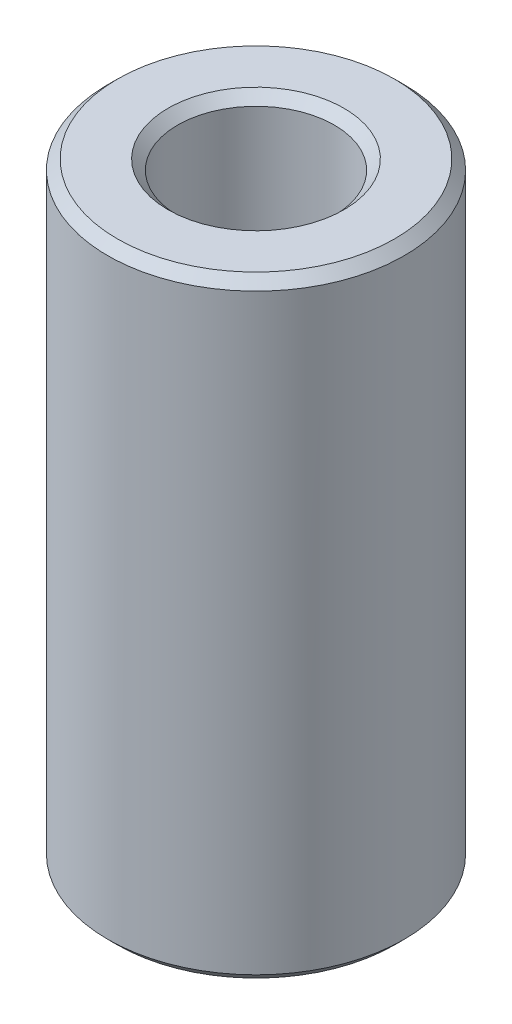
ISO-10303-21;
HEADER;
FILE_DESCRIPTION(('STEP AP214'),'2;1');
FILE_NAME('part.step','',(''),(''),'','','');
FILE_SCHEMA(('AUTOMOTIVE_DESIGN { 1 0 10303 214 1 1 1 1 }'));
ENDSEC;
DATA;
#1=APPLICATION_CONTEXT('core data for automotive mechanical design processes');
#2=APPLICATION_PROTOCOL_DEFINITION('international standard','automotive_design',2000,#1);
#3=PRODUCT_CONTEXT('',#1,'mechanical');
#4=PRODUCT('Part','Part','',(#3));
#5=PRODUCT_RELATED_PRODUCT_CATEGORY('part','',(#4));
#6=PRODUCT_DEFINITION_FORMATION('','',#4);
#7=PRODUCT_DEFINITION_CONTEXT('part definition',#1,'design');
#8=PRODUCT_DEFINITION('design','',#6,#7);
#9=PRODUCT_DEFINITION_SHAPE('','',#8);
#10=(LENGTH_UNIT() NAMED_UNIT(*) SI_UNIT(.MILLI.,.METRE.));
#11=(NAMED_UNIT(*) PLANE_ANGLE_UNIT() SI_UNIT($,.RADIAN.));
#12=(NAMED_UNIT(*) SI_UNIT($,.STERADIAN.) SOLID_ANGLE_UNIT());
#13=UNCERTAINTY_MEASURE_WITH_UNIT(LENGTH_MEASURE(1.E-05),#10,'distance_accuracy_value','');
#14=(GEOMETRIC_REPRESENTATION_CONTEXT(3) GLOBAL_UNCERTAINTY_ASSIGNED_CONTEXT((#13)) GLOBAL_UNIT_ASSIGNED_CONTEXT((#10,
#11,#12)) REPRESENTATION_CONTEXT('',''));
#15=CARTESIAN_POINT('',(0.,0.,0.));
#16=DIRECTION('',(0.,0.,1.));
#17=DIRECTION('',(1.,0.,0.));
#18=AXIS2_PLACEMENT_3D('',#15,#16,#17);
#19=CARTESIAN_POINT('',(0.,247.519173800323,0.));
#20=DIRECTION('',(0.,-1.,0.));
#21=DIRECTION('',(0.,0.,-1.));
#22=AXIS2_PLACEMENT_3D('',#19,#20,#21);
#23=CYLINDRICAL_SURFACE('',#22,60.);
#24=CARTESIAN_POINT('',(0.,3.92116083828875,0.));
#25=DIRECTION('',(0.,1.,0.));
#26=DIRECTION('',(0.,0.,1.));
#27=AXIS2_PLACEMENT_3D('',#24,#25,#26);
#28=CIRCLE('',#27,60.);
#29=CARTESIAN_POINT('',(0.,3.92116083828872,-60.));
#30=VERTEX_POINT('',#29);
#31=EDGE_CURVE('E10',#30,#30,#28,.T.);
#32=CARTESIAN_POINT('',(0.,243.598012962035,0.));
#33=DIRECTION('',(0.,1.,0.));
#34=DIRECTION('',(0.,0.,1.));
#35=AXIS2_PLACEMENT_3D('',#32,#33,#34);
#36=CIRCLE('',#35,60.);
#37=CARTESIAN_POINT('',(0.,243.598012962035,-60.));
#38=VERTEX_POINT('',#37);
#39=EDGE_CURVE('E50',#38,#38,#36,.F.);
#40=CARTESIAN_POINT('',(0.,3.92116083828872,-60.));
#41=CARTESIAN_POINT('',(0.,6.41779471457774,-60.));
#42=CARTESIAN_POINT('',(0.,8.91442859086676,-60.));
#43=CARTESIAN_POINT('',(0.,13.9076963434448,-60.));
#44=CARTESIAN_POINT('',(0.,16.4043302197338,-60.));
#45=CARTESIAN_POINT('',(0.,21.3975979723119,-60.));
#46=CARTESIAN_POINT('',(0.,23.8942318486009,-60.));
#47=CARTESIAN_POINT('',(0.,28.8874996011789,-60.));
#48=CARTESIAN_POINT('',(0.,31.384133477468,-60.));
#49=CARTESIAN_POINT('',(0.,36.377401230046,-60.));
#50=CARTESIAN_POINT('',(0.,38.874035106335,-60.));
#51=CARTESIAN_POINT('',(0.,43.8673028589131,-60.));
#52=CARTESIAN_POINT('',(0.,46.3639367352021,-60.));
#53=CARTESIAN_POINT('',(0.,51.3572044877801,-60.));
#54=CARTESIAN_POINT('',(0.,53.8538383640691,-60.));
#55=CARTESIAN_POINT('',(0.,58.8471061166472,-60.));
#56=CARTESIAN_POINT('',(0.,61.3437399929362,-60.));
#57=CARTESIAN_POINT('',(0.,66.3370077455143,-60.));
#58=CARTESIAN_POINT('',(0.,68.8336416218033,-60.));
#59=CARTESIAN_POINT('',(0.,73.8269093743813,-60.));
#60=CARTESIAN_POINT('',(0.,76.3235432506703,-60.));
#61=CARTESIAN_POINT('',(0.,81.3168110032484,-60.));
#62=CARTESIAN_POINT('',(0.,83.8134448795374,-60.));
#63=CARTESIAN_POINT('',(0.,88.8067126321154,-60.));
#64=CARTESIAN_POINT('',(0.,91.3033465084045,-60.));
#65=CARTESIAN_POINT('',(0.,96.2966142609825,-60.));
#66=CARTESIAN_POINT('',(0.,98.7932481372715,-60.));
#67=CARTESIAN_POINT('',(0.,103.78651588985,-60.));
#68=CARTESIAN_POINT('',(0.,106.283149766139,-60.));
#69=CARTESIAN_POINT('',(0.,111.276417518717,-60.));
#70=CARTESIAN_POINT('',(0.,113.773051395006,-60.));
#71=CARTESIAN_POINT('',(0.,118.766319147584,-60.));
#72=CARTESIAN_POINT('',(0.,121.262953023873,-60.));
#73=CARTESIAN_POINT('',(0.,126.256220776451,-60.));
#74=CARTESIAN_POINT('',(0.,128.75285465274,-60.));
#75=CARTESIAN_POINT('',(0.,133.746122405318,-60.));
#76=CARTESIAN_POINT('',(0.,136.242756281607,-60.));
#77=CARTESIAN_POINT('',(0.,141.236024034185,-60.));
#78=CARTESIAN_POINT('',(0.,143.732657910474,-60.));
#79=CARTESIAN_POINT('',(0.,148.725925663052,-60.));
#80=CARTESIAN_POINT('',(0.,151.222559539341,-60.));
#81=CARTESIAN_POINT('',(0.,156.215827291919,-60.));
#82=CARTESIAN_POINT('',(0.,158.712461168208,-60.));
#83=CARTESIAN_POINT('',(0.,163.705728920786,-60.));
#84=CARTESIAN_POINT('',(0.,166.202362797075,-60.));
#85=CARTESIAN_POINT('',(0.,171.195630549653,-60.));
#86=CARTESIAN_POINT('',(0.,173.692264425942,-60.));
#87=CARTESIAN_POINT('',(0.,178.68553217852,-60.));
#88=CARTESIAN_POINT('',(0.,181.182166054809,-60.));
#89=CARTESIAN_POINT('',(0.,186.175433807387,-60.));
#90=CARTESIAN_POINT('',(0.,188.672067683676,-60.));
#91=CARTESIAN_POINT('',(0.,193.665335436254,-60.));
#92=CARTESIAN_POINT('',(0.,196.161969312543,-60.));
#93=CARTESIAN_POINT('',(0.,201.155237065121,-60.));
#94=CARTESIAN_POINT('',(0.,203.65187094141,-60.));
#95=CARTESIAN_POINT('',(0.,208.645138693988,-60.));
#96=CARTESIAN_POINT('',(0.,211.141772570277,-60.));
#97=CARTESIAN_POINT('',(0.,216.135040322856,-60.));
#98=CARTESIAN_POINT('',(0.,218.631674199145,-60.));
#99=CARTESIAN_POINT('',(0.,223.624941951723,-60.));
#100=CARTESIAN_POINT('',(0.,226.121575828012,-60.));
#101=CARTESIAN_POINT('',(0.,231.11484358059,-60.));
#102=CARTESIAN_POINT('',(0.,233.611477456879,-60.));
#103=CARTESIAN_POINT('',(0.,238.604745209457,-60.));
#104=CARTESIAN_POINT('',(0.,241.101379085746,-60.));
#105=CARTESIAN_POINT('',(0.,243.598012962035,-60.));
#106=B_SPLINE_CURVE_WITH_KNOTS('',3,(#40,#41,#42,#43,#44,#45,#46,#47,#48,#49,#50,#51,#52,#53,
#54,#55,#56,#57,#58,#59,#60,#61,#62,#63,#64,#65,#66,#67,#68,#69,#70,#71,#72,#73,#74,#75,#76,#77,
#78,#79,#80,#81,#82,#83,#84,#85,#86,#87,#88,#89,#90,#91,#92,#93,#94,#95,#96,#97,#98,#99,#100,
#101,#102,#103,#104,#105),.UNSPECIFIED.,.F.,.F.,(4,2,2,2,2,2,2,2,2,2,2,2,2,2,2,2,2,2,2,2,2,2,2,
2,2,2,2,2,2,2,2,2,4),(0.,7.48990162886706,14.9798032577341,22.4697048866012,29.9596065154683,
37.4495081443353,44.9394097732024,52.4293114020694,59.9192130309365,67.4091146598036,
74.8990162886706,82.3889179175377,89.8788195464048,97.3687211752718,104.858622804139,
112.348524433006,119.838426061873,127.32832769074,134.818229319607,142.308130948474,
149.798032577341,157.287934206208,164.777835835075,172.267737463942,179.75763909281,
187.247540721677,194.737442350544,202.227343979411,209.717245608278,217.207147237145,
224.697048866012,232.186950494879,239.676852123746),.UNSPECIFIED.);
#107=EDGE_CURVE('BSEAM39',#30,#38,#106,.T.);
#108=ORIENTED_EDGE('',*,*,#31,.T.);
#109=ORIENTED_EDGE('',*,*,#39,.T.);
#110=ORIENTED_EDGE('',*,*,#107,.T.);
#111=ORIENTED_EDGE('',*,*,#107,.F.);
#112=EDGE_LOOP('',(#108,#110,#109,#111));
#113=FACE_BOUND('',#112,.T.);
#114=ADVANCED_FACE('F39',(#113),#23,.T.);
#115=CARTESIAN_POINT('',(0.,247.519173800323,0.));
#116=DIRECTION('',(0.,1.,0.));
#117=DIRECTION('',(0.,0.,1.));
#118=AXIS2_PLACEMENT_3D('',#115,#116,#117);
#119=PLANE('',#118);
#120=CARTESIAN_POINT('',(0.,247.519173800323,0.));
#121=DIRECTION('',(0.,1.,0.));
#122=DIRECTION('',(0.,0.,1.));
#123=AXIS2_PLACEMENT_3D('',#120,#121,#122);
#124=CIRCLE('',#123,35.6135920327482);
#125=CARTESIAN_POINT('',(0.,247.519173800323,35.6135920327482));
#126=VERTEX_POINT('',#125);
#127=EDGE_CURVE('E58',#126,#126,#124,.F.);
#128=ORIENTED_EDGE('',*,*,#127,.T.);
#129=EDGE_LOOP('',(#128));
#130=FACE_BOUND('',#129,.T.);
#131=CARTESIAN_POINT('',(0.,247.519173800323,0.));
#132=DIRECTION('',(0.,1.,0.));
#133=DIRECTION('',(0.,0.,1.));
#134=AXIS2_PLACEMENT_3D('',#131,#132,#133);
#135=CIRCLE('',#134,56.0788391617117);
#136=CARTESIAN_POINT('',(0.,247.519173800323,56.0788391617117));
#137=VERTEX_POINT('',#136);
#138=EDGE_CURVE('E61',#137,#137,#135,.T.);
#139=ORIENTED_EDGE('',*,*,#138,.T.);
#140=EDGE_LOOP('',(#139));
#141=FACE_BOUND('',#140,.T.);
#142=ADVANCED_FACE('F88',(#130,#141),#119,.T.);
#143=CARTESIAN_POINT('',(0.,0.,0.));
#144=DIRECTION('',(0.,1.,0.));
#145=DIRECTION('',(0.,0.,1.));
#146=AXIS2_PLACEMENT_3D('',#143,#144,#145);
#147=PLANE('',#146);
#148=CARTESIAN_POINT('',(0.,0.,0.));
#149=DIRECTION('',(0.,1.,0.));
#150=DIRECTION('',(0.,0.,1.));
#151=AXIS2_PLACEMENT_3D('',#148,#149,#150);
#152=CIRCLE('',#151,35.6135920327481);
#153=CARTESIAN_POINT('',(0.,0.,35.6135920327481));
#154=VERTEX_POINT('',#153);
#155=EDGE_CURVE('E51',#154,#154,#152,.T.);
#156=ORIENTED_EDGE('',*,*,#155,.T.);
#157=EDGE_LOOP('',(#156));
#158=FACE_BOUND('',#157,.T.);
#159=CARTESIAN_POINT('',(0.,0.,0.));
#160=DIRECTION('',(0.,1.,0.));
#161=DIRECTION('',(0.,0.,1.));
#162=AXIS2_PLACEMENT_3D('',#159,#160,#161);
#163=CIRCLE('',#162,56.0788391617112);
#164=CARTESIAN_POINT('',(0.,0.,56.0788391617112));
#165=VERTEX_POINT('',#164);
#166=EDGE_CURVE('E54',#165,#165,#163,.F.);
#167=ORIENTED_EDGE('',*,*,#166,.T.);
#168=EDGE_LOOP('',(#167));
#169=FACE_BOUND('',#168,.T.);
#170=ADVANCED_FACE('F83',(#158,#169),#147,.F.);
#171=CARTESIAN_POINT('',(0.,247.519173800323,0.));
#172=DIRECTION('',(0.,-1.,0.));
#173=DIRECTION('',(0.,0.,-1.));
#174=AXIS2_PLACEMENT_3D('',#171,#172,#173);
#175=CYLINDRICAL_SURFACE('',#174,31.6924311944596);
#176=CARTESIAN_POINT('',(0.,243.598012962034,0.));
#177=DIRECTION('',(0.,1.,0.));
#178=DIRECTION('',(0.,0.,1.));
#179=AXIS2_PLACEMENT_3D('',#176,#177,#178);
#180=CIRCLE('',#179,31.6924311944596);
#181=CARTESIAN_POINT('',(0.,243.598012962034,-31.6924311944596));
#182=VERTEX_POINT('',#181);
#183=EDGE_CURVE('E67',#182,#182,#180,.T.);
#184=CARTESIAN_POINT('',(0.,3.9211608382885,0.));
#185=DIRECTION('',(0.,1.,0.));
#186=DIRECTION('',(0.,0.,1.));
#187=AXIS2_PLACEMENT_3D('',#184,#185,#186);
#188=CIRCLE('',#187,31.6924311944596);
#189=CARTESIAN_POINT('',(0.,3.9211608382885,-31.6924311944596));
#190=VERTEX_POINT('',#189);
#191=EDGE_CURVE('E69',#190,#190,#188,.F.);
#192=CARTESIAN_POINT('',(0.,243.598012962034,-31.6924311944596));
#193=CARTESIAN_POINT('',(0.,241.101379085745,-31.6924311944596));
#194=CARTESIAN_POINT('',(0.,238.604745209456,-31.6924311944596));
#195=CARTESIAN_POINT('',(0.,233.611477456878,-31.6924311944596));
#196=CARTESIAN_POINT('',(0.,231.114843580589,-31.6924311944596));
#197=CARTESIAN_POINT('',(0.,226.121575828011,-31.6924311944596));
#198=CARTESIAN_POINT('',(0.,223.624941951722,-31.6924311944596));
#199=CARTESIAN_POINT('',(0.,218.631674199144,-31.6924311944596));
#200=CARTESIAN_POINT('',(0.,216.135040322855,-31.6924311944596));
#201=CARTESIAN_POINT('',(0.,211.141772570277,-31.6924311944596));
#202=CARTESIAN_POINT('',(0.,208.645138693988,-31.6924311944596));
#203=CARTESIAN_POINT('',(0.,203.65187094141,-31.6924311944596));
#204=CARTESIAN_POINT('',(0.,201.155237065121,-31.6924311944596));
#205=CARTESIAN_POINT('',(0.,196.161969312543,-31.6924311944596));
#206=CARTESIAN_POINT('',(0.,193.665335436254,-31.6924311944596));
#207=CARTESIAN_POINT('',(0.,188.672067683676,-31.6924311944596));
#208=CARTESIAN_POINT('',(0.,186.175433807387,-31.6924311944596));
#209=CARTESIAN_POINT('',(0.,181.182166054809,-31.6924311944596));
#210=CARTESIAN_POINT('',(0.,178.68553217852,-31.6924311944596));
#211=CARTESIAN_POINT('',(0.,173.692264425942,-31.6924311944596));
#212=CARTESIAN_POINT('',(0.,171.195630549653,-31.6924311944596));
#213=CARTESIAN_POINT('',(0.,166.202362797075,-31.6924311944596));
#214=CARTESIAN_POINT('',(0.,163.705728920786,-31.6924311944596));
#215=CARTESIAN_POINT('',(0.,158.712461168208,-31.6924311944596));
#216=CARTESIAN_POINT('',(0.,156.215827291919,-31.6924311944596));
#217=CARTESIAN_POINT('',(0.,151.222559539341,-31.6924311944596));
#218=CARTESIAN_POINT('',(0.,148.725925663052,-31.6924311944596));
#219=CARTESIAN_POINT('',(0.,143.732657910474,-31.6924311944596));
#220=CARTESIAN_POINT('',(0.,141.236024034185,-31.6924311944596));
#221=CARTESIAN_POINT('',(0.,136.242756281607,-31.6924311944596));
#222=CARTESIAN_POINT('',(0.,133.746122405318,-31.6924311944596));
#223=CARTESIAN_POINT('',(0.,128.75285465274,-31.6924311944596));
#224=CARTESIAN_POINT('',(0.,126.256220776451,-31.6924311944596));
#225=CARTESIAN_POINT('',(0.,121.262953023872,-31.6924311944596));
#226=CARTESIAN_POINT('',(0.,118.766319147583,-31.6924311944596));
#227=CARTESIAN_POINT('',(0.,113.773051395005,-31.6924311944596));
#228=CARTESIAN_POINT('',(0.,111.276417518716,-31.6924311944596));
#229=CARTESIAN_POINT('',(0.,106.283149766138,-31.6924311944596));
#230=CARTESIAN_POINT('',(0.,103.786515889849,-31.6924311944596));
#231=CARTESIAN_POINT('',(0.,98.7932481372713,-31.6924311944596));
#232=CARTESIAN_POINT('',(0.,96.2966142609823,-31.6924311944596));
#233=CARTESIAN_POINT('',(0.,91.3033465084042,-31.6924311944596));
#234=CARTESIAN_POINT('',(0.,88.8067126321152,-31.6924311944596));
#235=CARTESIAN_POINT('',(0.,83.8134448795372,-31.6924311944596));
#236=CARTESIAN_POINT('',(0.,81.3168110032481,-31.6924311944596));
#237=CARTESIAN_POINT('',(0.,76.3235432506701,-31.6924311944596));
#238=CARTESIAN_POINT('',(0.,73.8269093743811,-31.6924311944596));
#239=CARTESIAN_POINT('',(0.,68.833641621803,-31.6924311944596));
#240=CARTESIAN_POINT('',(0.,66.337007745514,-31.6924311944596));
#241=CARTESIAN_POINT('',(0.,61.343739992936,-31.6924311944596));
#242=CARTESIAN_POINT('',(0.,58.847106116647,-31.6924311944596));
#243=CARTESIAN_POINT('',(0.,53.8538383640689,-31.6924311944596));
#244=CARTESIAN_POINT('',(0.,51.3572044877799,-31.6924311944596));
#245=CARTESIAN_POINT('',(0.,46.3639367352019,-31.6924311944596));
#246=CARTESIAN_POINT('',(0.,43.8673028589128,-31.6924311944596));
#247=CARTESIAN_POINT('',(0.,38.8740351063348,-31.6924311944596));
#248=CARTESIAN_POINT('',(0.,36.3774012300458,-31.6924311944596));
#249=CARTESIAN_POINT('',(0.,31.3841334774677,-31.6924311944596));
#250=CARTESIAN_POINT('',(0.,28.8874996011787,-31.6924311944596));
#251=CARTESIAN_POINT('',(0.,23.8942318486007,-31.6924311944596));
#252=CARTESIAN_POINT('',(0.,21.3975979723116,-31.6924311944596));
#253=CARTESIAN_POINT('',(0.,16.4043302197336,-31.6924311944596));
#254=CARTESIAN_POINT('',(0.,13.9076963434446,-31.6924311944596));
#255=CARTESIAN_POINT('',(0.,8.91442859086654,-31.6924311944596));
#256=CARTESIAN_POINT('',(0.,6.41779471457752,-31.6924311944596));
#257=CARTESIAN_POINT('',(0.,3.9211608382885,-31.6924311944596));
#258=B_SPLINE_CURVE_WITH_KNOTS('',3,(#192,#193,#194,#195,#196,#197,#198,#199,#200,#201,#202,
#203,#204,#205,#206,#207,#208,#209,#210,#211,#212,#213,#214,#215,#216,#217,#218,#219,#220,#221,
#222,#223,#224,#225,#226,#227,#228,#229,#230,#231,#232,#233,#234,#235,#236,#237,#238,#239,#240,
#241,#242,#243,#244,#245,#246,#247,#248,#249,#250,#251,#252,#253,#254,#255,#256,#257),
.UNSPECIFIED.,.F.,.F.,(4,2,2,2,2,2,2,2,2,2,2,2,2,2,2,2,2,2,2,2,2,2,2,2,2,2,2,2,2,2,2,2,4),(0.,
7.48990162886703,14.9798032577341,22.4697048866012,29.9596065154682,37.4495081443353,
44.9394097732023,52.4293114020694,59.9192130309365,67.4091146598035,74.8990162886706,
82.3889179175376,89.8788195464047,97.3687211752718,104.858622804139,112.348524433006,
119.838426061873,127.32832769074,134.818229319607,142.308130948474,149.798032577341,
157.287934206208,164.777835835075,172.267737463942,179.757639092809,187.247540721677,
194.737442350544,202.227343979411,209.717245608278,217.207147237145,224.697048866012,
232.186950494879,239.676852123746),.UNSPECIFIED.);
#259=EDGE_CURVE('BSEAM71',#182,#190,#258,.T.);
#260=ORIENTED_EDGE('',*,*,#183,.T.);
#261=ORIENTED_EDGE('',*,*,#191,.T.);
#262=ORIENTED_EDGE('',*,*,#259,.T.);
#263=ORIENTED_EDGE('',*,*,#259,.F.);
#264=EDGE_LOOP('',(#260,#262,#261,#263));
#265=FACE_BOUND('',#264,.T.);
#266=ADVANCED_FACE('F71',(#265),#175,.F.);
#267=CARTESIAN_POINT('',(0.,243.598012962034,0.));
#268=DIRECTION('',(0.,1.,0.));
#269=DIRECTION('',(0.,0.,1.));
#270=AXIS2_PLACEMENT_3D('',#267,#268,#269);
#271=CONICAL_SURFACE('',#270,31.6924311944596,0.785398163397447);
#272=ORIENTED_EDGE('',*,*,#127,.F.);
#273=EDGE_LOOP('',(#272));
#274=FACE_BOUND('',#273,.T.);
#275=ORIENTED_EDGE('',*,*,#183,.F.);
#276=EDGE_LOOP('',(#275));
#277=FACE_BOUND('',#276,.T.);
#278=ADVANCED_FACE('F77',(#274,#277),#271,.F.);
#279=CARTESIAN_POINT('',(0.,0.,0.));
#280=DIRECTION('',(0.,-1.,0.));
#281=DIRECTION('',(0.,0.,-1.));
#282=AXIS2_PLACEMENT_3D('',#279,#280,#281);
#283=CONICAL_SURFACE('',#282,35.6135920327481,0.785398163397444);
#284=ORIENTED_EDGE('',*,*,#191,.F.);
#285=EDGE_LOOP('',(#284));
#286=FACE_BOUND('',#285,.T.);
#287=ORIENTED_EDGE('',*,*,#155,.F.);
#288=EDGE_LOOP('',(#287));
#289=FACE_BOUND('',#288,.T.);
#290=ADVANCED_FACE('F73',(#286,#289),#283,.F.);
#291=CARTESIAN_POINT('',(0.,3.92116083828875,0.));
#292=DIRECTION('',(0.,1.,0.));
#293=DIRECTION('',(0.,0.,1.));
#294=AXIS2_PLACEMENT_3D('',#291,#292,#293);
#295=CONICAL_SURFACE('',#294,60.,0.78539816339745);
#296=ORIENTED_EDGE('',*,*,#166,.F.);
#297=EDGE_LOOP('',(#296));
#298=FACE_BOUND('',#297,.T.);
#299=ORIENTED_EDGE('',*,*,#31,.F.);
#300=EDGE_LOOP('',(#299));
#301=FACE_BOUND('',#300,.T.);
#302=ADVANCED_FACE('F76',(#298,#301),#295,.T.);
#303=CARTESIAN_POINT('',(0.,247.519173800323,0.));
#304=DIRECTION('',(0.,-1.,0.));
#305=DIRECTION('',(0.,0.,-1.));
#306=AXIS2_PLACEMENT_3D('',#303,#304,#305);
#307=CONICAL_SURFACE('',#306,56.0788391617117,0.785398163397442);
#308=ORIENTED_EDGE('',*,*,#39,.F.);
#309=EDGE_LOOP('',(#308));
#310=FACE_BOUND('',#309,.T.);
#311=ORIENTED_EDGE('',*,*,#138,.F.);
#312=EDGE_LOOP('',(#311));
#313=FACE_BOUND('',#312,.T.);
#314=ADVANCED_FACE('F45',(#310,#313),#307,.T.);
#315=CLOSED_SHELL('',(#114,#142,#170,#266,#278,#290,#302,#314));
#316=MANIFOLD_SOLID_BREP('B2',#315);
#317=ADVANCED_BREP_SHAPE_REPRESENTATION('',(#18,#316),#14);
#318=SHAPE_DEFINITION_REPRESENTATION(#9,#317);
ENDSEC;
END-ISO-10303-21;
